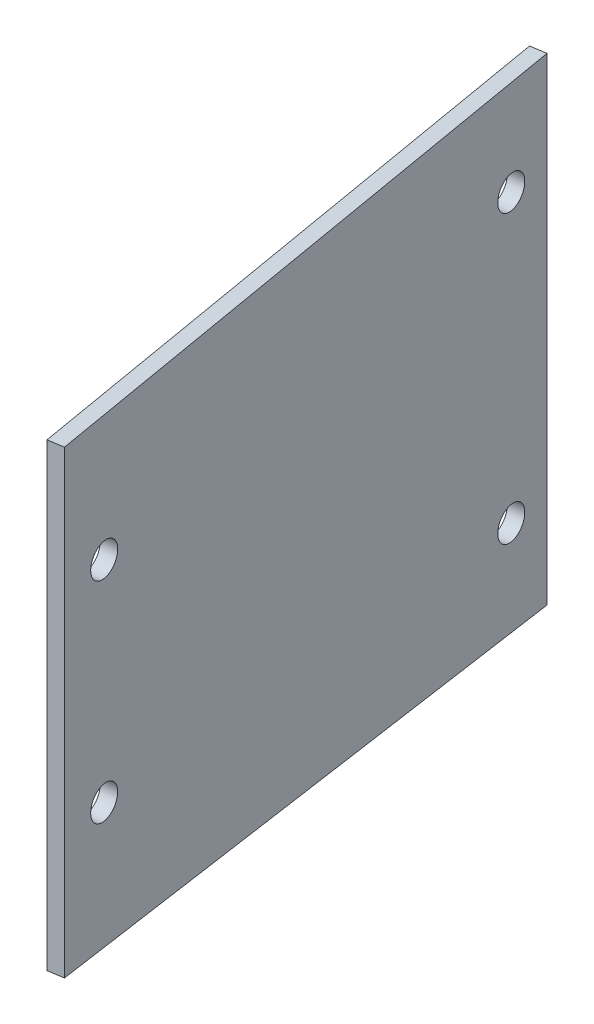
ISO-10303-21;
HEADER;
FILE_DESCRIPTION(('STEP AP214'),'2;1');
FILE_NAME('part.step','',(''),(''),'','','');
FILE_SCHEMA(('AUTOMOTIVE_DESIGN { 1 0 10303 214 1 1 1 1 }'));
ENDSEC;
DATA;
#1=APPLICATION_CONTEXT('core data for automotive mechanical design processes');
#2=APPLICATION_PROTOCOL_DEFINITION('international standard','automotive_design',2000,#1);
#3=PRODUCT_CONTEXT('',#1,'mechanical');
#4=PRODUCT('Part','Part','',(#3));
#5=PRODUCT_RELATED_PRODUCT_CATEGORY('part','',(#4));
#6=PRODUCT_DEFINITION_FORMATION('','',#4);
#7=PRODUCT_DEFINITION_CONTEXT('part definition',#1,'design');
#8=PRODUCT_DEFINITION('design','',#6,#7);
#9=PRODUCT_DEFINITION_SHAPE('','',#8);
#10=(LENGTH_UNIT() NAMED_UNIT(*) SI_UNIT(.MILLI.,.METRE.));
#11=(NAMED_UNIT(*) PLANE_ANGLE_UNIT() SI_UNIT($,.RADIAN.));
#12=(NAMED_UNIT(*) SI_UNIT($,.STERADIAN.) SOLID_ANGLE_UNIT());
#13=UNCERTAINTY_MEASURE_WITH_UNIT(LENGTH_MEASURE(1.E-05),#10,'distance_accuracy_value','');
#14=(GEOMETRIC_REPRESENTATION_CONTEXT(3) GLOBAL_UNCERTAINTY_ASSIGNED_CONTEXT((#13)) GLOBAL_UNIT_ASSIGNED_CONTEXT((#10,
#11,#12)) REPRESENTATION_CONTEXT('',''));
#15=CARTESIAN_POINT('',(0.,0.,0.));
#16=DIRECTION('',(0.,0.,1.));
#17=DIRECTION('',(1.,0.,0.));
#18=AXIS2_PLACEMENT_3D('',#15,#16,#17);
#19=CARTESIAN_POINT('',(-26.41968617812,-24.0560531885734,10.784783644869));
#20=DIRECTION('',(-0.156385221956874,0.,-0.987696138674997));
#21=DIRECTION('',(-0.987696138674997,0.,0.156385221956874));
#22=AXIS2_PLACEMENT_3D('',#19,#20,#21);
#23=PLANE('',#22);
#24=DIRECTION('',(0.,-1.,0.));
#25=VECTOR('',#24,1.);
#26=CARTESIAN_POINT('',(-28.,-24.0560531885734,11.035));
#27=LINE('',#26,#25);
#28=CARTESIAN_POINT('',(-28.,24.0560531885734,11.035));
#29=VERTEX_POINT('',#28);
#30=CARTESIAN_POINT('',(-28.,-24.0560531885734,11.035));
#31=VERTEX_POINT('',#30);
#32=EDGE_CURVE('E103',#29,#31,#27,.T.);
#33=ORIENTED_EDGE('',*,*,#32,.T.);
#34=DIRECTION('',(-0.987696138674997,0.,0.156385221956874));
#35=VECTOR('',#34,1.);
#36=CARTESIAN_POINT('',(-26.41968617812,-24.0560531885734,10.784783644869));
#37=LINE('',#36,#35);
#38=CARTESIAN_POINT('',(-26.41968617812,-24.0560531885734,10.784783644869));
#39=VERTEX_POINT('',#38);
#40=EDGE_CURVE('E11',#39,#31,#37,.T.);
#41=ORIENTED_EDGE('',*,*,#40,.F.);
#42=DIRECTION('',(0.,-1.,0.));
#43=VECTOR('',#42,1.);
#44=CARTESIAN_POINT('',(-26.41968617812,-24.0560531885734,10.784783644869));
#45=LINE('',#44,#43);
#46=CARTESIAN_POINT('',(-26.41968617812,24.0560531885734,10.784783644869));
#47=VERTEX_POINT('',#46);
#48=EDGE_CURVE('E91',#47,#39,#45,.T.);
#49=ORIENTED_EDGE('',*,*,#48,.F.);
#50=DIRECTION('',(-0.987696138674997,0.,0.156385221956874));
#51=VECTOR('',#50,1.);
#52=CARTESIAN_POINT('',(-26.41968617812,24.0560531885734,10.784783644869));
#53=LINE('',#52,#51);
#54=EDGE_CURVE('E99',#47,#29,#53,.T.);
#55=ORIENTED_EDGE('',*,*,#54,.T.);
#56=EDGE_LOOP('',(#33,#41,#49,#55));
#57=FACE_BOUND('',#56,.T.);
#58=ADVANCED_FACE('F40',(#57),#23,.F.);
#59=CARTESIAN_POINT('',(-35.91968617812,-25.,-49.215216355131));
#60=DIRECTION('',(-0.00242975740769189,0.999879293509196,-0.0153458362591067));
#61=DIRECTION('',(0.,0.0153458815580756,0.999882245026486));
#62=AXIS2_PLACEMENT_3D('',#59,#60,#61);
#63=PLANE('',#62);
#64=DIRECTION('',(-0.156366345245518,-0.0155370013693617,-0.987576917340117));
#65=VECTOR('',#64,1.);
#66=CARTESIAN_POINT('',(-37.5,-25.,-48.965));
#67=LINE('',#66,#65);
#68=CARTESIAN_POINT('',(-37.5,-25.,-48.965));
#69=VERTEX_POINT('',#68);
#70=EDGE_CURVE('E95',#31,#69,#67,.T.);
#71=ORIENTED_EDGE('',*,*,#70,.T.);
#72=DIRECTION('',(-0.987696138674997,0.,0.156385221956874));
#73=VECTOR('',#72,1.);
#74=CARTESIAN_POINT('',(-35.91968617812,-25.,-49.215216355131));
#75=LINE('',#74,#73);
#76=CARTESIAN_POINT('',(-35.91968617812,-25.,-49.215216355131));
#77=VERTEX_POINT('',#76);
#78=EDGE_CURVE('E48',#77,#69,#75,.T.);
#79=ORIENTED_EDGE('',*,*,#78,.F.);
#80=DIRECTION('',(-0.156366345245518,-0.0155370013693617,-0.987576917340117));
#81=VECTOR('',#80,1.);
#82=CARTESIAN_POINT('',(-35.91968617812,-25.,-49.215216355131));
#83=LINE('',#82,#81);
#84=EDGE_CURVE('E86',#39,#77,#83,.T.);
#85=ORIENTED_EDGE('',*,*,#84,.F.);
#86=ORIENTED_EDGE('',*,*,#40,.T.);
#87=EDGE_LOOP('',(#71,#79,#85,#86));
#88=FACE_BOUND('',#87,.T.);
#89=ADVANCED_FACE('F94',(#88),#63,.F.);
#90=CARTESIAN_POINT('',(-35.91968617812,25.,-49.215216355131));
#91=DIRECTION('',(0.156385221956874,0.,0.987696138674997));
#92=DIRECTION('',(0.987696138674997,0.,-0.156385221956874));
#93=AXIS2_PLACEMENT_3D('',#90,#91,#92);
#94=PLANE('',#93);
#95=DIRECTION('',(0.,1.,0.));
#96=VECTOR('',#95,1.);
#97=CARTESIAN_POINT('',(-37.5,25.,-48.965));
#98=LINE('',#97,#96);
#99=CARTESIAN_POINT('',(-37.5,25.,-48.965));
#100=VERTEX_POINT('',#99);
#101=EDGE_CURVE('E73',#69,#100,#98,.T.);
#102=ORIENTED_EDGE('',*,*,#101,.T.);
#103=DIRECTION('',(-0.987696138674997,0.,0.156385221956874));
#104=VECTOR('',#103,1.);
#105=CARTESIAN_POINT('',(-35.91968617812,25.,-49.215216355131));
#106=LINE('',#105,#104);
#107=CARTESIAN_POINT('',(-35.91968617812,25.,-49.215216355131));
#108=VERTEX_POINT('',#107);
#109=EDGE_CURVE('E96',#108,#100,#106,.T.);
#110=ORIENTED_EDGE('',*,*,#109,.F.);
#111=DIRECTION('',(0.,1.,0.));
#112=VECTOR('',#111,1.);
#113=CARTESIAN_POINT('',(-35.91968617812,25.,-49.215216355131));
#114=LINE('',#113,#112);
#115=EDGE_CURVE('E89',#77,#108,#114,.T.);
#116=ORIENTED_EDGE('',*,*,#115,.F.);
#117=ORIENTED_EDGE('',*,*,#78,.T.);
#118=EDGE_LOOP('',(#102,#110,#116,#117));
#119=FACE_BOUND('',#118,.T.);
#120=ADVANCED_FACE('F97',(#119),#94,.F.);
#121=CARTESIAN_POINT('',(-26.41968617812,24.0560531885734,10.784783644869));
#122=DIRECTION('',(-0.00242975740769189,-0.999879293509196,-0.0153458362591067));
#123=DIRECTION('',(0.,0.0153458815580756,-0.999882245026486));
#124=AXIS2_PLACEMENT_3D('',#121,#122,#123);
#125=PLANE('',#124);
#126=DIRECTION('',(0.156366345245518,-0.0155370013693617,0.987576917340117));
#127=VECTOR('',#126,1.);
#128=CARTESIAN_POINT('',(-28.,24.0560531885734,11.035));
#129=LINE('',#128,#127);
#130=EDGE_CURVE('E79',#100,#29,#129,.T.);
#131=ORIENTED_EDGE('',*,*,#130,.T.);
#132=ORIENTED_EDGE('',*,*,#54,.F.);
#133=DIRECTION('',(0.156366345245518,-0.0155370013693617,0.987576917340117));
#134=VECTOR('',#133,1.);
#135=CARTESIAN_POINT('',(-26.41968617812,24.0560531885734,10.784783644869));
#136=LINE('',#135,#134);
#137=EDGE_CURVE('E56',#108,#47,#136,.T.);
#138=ORIENTED_EDGE('',*,*,#137,.F.);
#139=ORIENTED_EDGE('',*,*,#109,.T.);
#140=EDGE_LOOP('',(#131,#132,#138,#139));
#141=FACE_BOUND('',#140,.T.);
#142=ADVANCED_FACE('F111',(#141),#125,.F.);
#143=CARTESIAN_POINT('',(-27.4393867404125,0.,4.34456956723198));
#144=DIRECTION('',(-0.987696138674997,0.,0.156385221956874));
#145=DIRECTION('',(0.156385221956874,0.,0.987696138674997));
#146=AXIS2_PLACEMENT_3D('',#143,#144,#145);
#147=PLANE('',#146);
#148=CARTESIAN_POINT('',(-35.2159526793141,15.,-44.7705837310935));
#149=DIRECTION('',(-0.987696138674997,0.,0.156385221956874));
#150=DIRECTION('',(0.156385221956874,0.,0.987696138674997));
#151=AXIS2_PLACEMENT_3D('',#148,#149,#150);
#152=CIRCLE('',#151,1.69999999999999);
#153=CARTESIAN_POINT('',(-34.9500978019874,15.,-43.091500295346));
#154=VERTEX_POINT('',#153);
#155=EDGE_CURVE('E126',#154,#154,#152,.T.);
#156=ORIENTED_EDGE('',*,*,#155,.T.);
#157=EDGE_LOOP('',(#156));
#158=FACE_BOUND('',#157,.T.);
#159=CARTESIAN_POINT('',(-35.2159526793141,-15.,-44.7705837310935));
#160=DIRECTION('',(-0.987696138674997,0.,0.156385221956874));
#161=DIRECTION('',(0.156385221956874,0.,0.987696138674997));
#162=AXIS2_PLACEMENT_3D('',#159,#160,#161);
#163=CIRCLE('',#162,1.7);
#164=CARTESIAN_POINT('',(-34.9500978019874,-15.,-43.091500295346));
#165=VERTEX_POINT('',#164);
#166=EDGE_CURVE('E131',#165,#165,#163,.T.);
#167=ORIENTED_EDGE('',*,*,#166,.T.);
#168=EDGE_LOOP('',(#167));
#169=FACE_BOUND('',#168,.T.);
#170=CARTESIAN_POINT('',(-27.2016122879044,-11.,5.84630295149402));
#171=DIRECTION('',(-0.987696138674997,0.,0.156385221956874));
#172=DIRECTION('',(0.156385221956874,0.,0.987696138674997));
#173=AXIS2_PLACEMENT_3D('',#170,#171,#172);
#174=CIRCLE('',#173,1.7);
#175=CARTESIAN_POINT('',(-26.9357574105777,-11.,7.52538638724152));
#176=VERTEX_POINT('',#175);
#177=EDGE_CURVE('E106',#176,#176,#174,.T.);
#178=ORIENTED_EDGE('',*,*,#177,.T.);
#179=EDGE_LOOP('',(#178));
#180=FACE_BOUND('',#179,.T.);
#181=CARTESIAN_POINT('',(-27.2016122879044,11.,5.84630295149401));
#182=DIRECTION('',(-0.987696138674997,0.,0.156385221956874));
#183=DIRECTION('',(0.156385221956874,0.,0.987696138674997));
#184=AXIS2_PLACEMENT_3D('',#181,#182,#183);
#185=CIRCLE('',#184,1.7);
#186=CARTESIAN_POINT('',(-26.9357574105777,11.,7.52538638724151));
#187=VERTEX_POINT('',#186);
#188=EDGE_CURVE('E119',#187,#187,#185,.T.);
#189=ORIENTED_EDGE('',*,*,#188,.T.);
#190=EDGE_LOOP('',(#189));
#191=FACE_BOUND('',#190,.T.);
#192=ORIENTED_EDGE('',*,*,#48,.T.);
#193=ORIENTED_EDGE('',*,*,#84,.T.);
#194=ORIENTED_EDGE('',*,*,#115,.T.);
#195=ORIENTED_EDGE('',*,*,#137,.T.);
#196=EDGE_LOOP('',(#192,#193,#194,#195));
#197=FACE_BOUND('',#196,.T.);
#198=ADVANCED_FACE('F87',(#158,#169,#180,#191,#197),#147,.F.);
#199=CARTESIAN_POINT('',(-29.0197005622925,0.,4.59478592236298));
#200=DIRECTION('',(-0.987696138674997,0.,0.156385221956874));
#201=DIRECTION('',(0.156385221956874,0.,0.987696138674997));
#202=AXIS2_PLACEMENT_3D('',#199,#200,#201);
#203=PLANE('',#202);
#204=CARTESIAN_POINT('',(-36.7962665011941,15.,-44.5203673759625));
#205=DIRECTION('',(-0.987696138674997,0.,0.156385221956874));
#206=DIRECTION('',(0.156385221956874,0.,0.987696138674997));
#207=AXIS2_PLACEMENT_3D('',#204,#205,#206);
#208=CIRCLE('',#207,1.69999999999999);
#209=CARTESIAN_POINT('',(-36.5304116238674,15.,-42.841283940215));
#210=VERTEX_POINT('',#209);
#211=EDGE_CURVE('E134',#210,#210,#208,.T.);
#212=ORIENTED_EDGE('',*,*,#211,.F.);
#213=EDGE_LOOP('',(#212));
#214=FACE_BOUND('',#213,.T.);
#215=CARTESIAN_POINT('',(-36.7962665011941,-15.,-44.5203673759625));
#216=DIRECTION('',(-0.987696138674997,0.,0.156385221956874));
#217=DIRECTION('',(0.156385221956874,0.,0.987696138674997));
#218=AXIS2_PLACEMENT_3D('',#215,#216,#217);
#219=CIRCLE('',#218,1.7);
#220=CARTESIAN_POINT('',(-36.5304116238674,-15.,-42.841283940215));
#221=VERTEX_POINT('',#220);
#222=EDGE_CURVE('E135',#221,#221,#219,.T.);
#223=ORIENTED_EDGE('',*,*,#222,.F.);
#224=EDGE_LOOP('',(#223));
#225=FACE_BOUND('',#224,.T.);
#226=CARTESIAN_POINT('',(-28.7819261097844,-11.,6.09651930662502));
#227=DIRECTION('',(-0.987696138674997,0.,0.156385221956874));
#228=DIRECTION('',(0.156385221956874,0.,0.987696138674997));
#229=AXIS2_PLACEMENT_3D('',#226,#227,#228);
#230=CIRCLE('',#229,1.7);
#231=CARTESIAN_POINT('',(-28.5160712324577,-11.,7.77560274237252));
#232=VERTEX_POINT('',#231);
#233=EDGE_CURVE('E122',#232,#232,#230,.T.);
#234=ORIENTED_EDGE('',*,*,#233,.F.);
#235=EDGE_LOOP('',(#234));
#236=FACE_BOUND('',#235,.T.);
#237=CARTESIAN_POINT('',(-28.7819261097844,11.,6.09651930662502));
#238=DIRECTION('',(-0.987696138674997,0.,0.156385221956874));
#239=DIRECTION('',(-0.156385221956874,0.,-0.987696138674997));
#240=AXIS2_PLACEMENT_3D('',#237,#238,#239);
#241=CIRCLE('',#240,1.7);
#242=CARTESIAN_POINT('',(-29.0477809871111,11.,4.41743587087752));
#243=VERTEX_POINT('',#242);
#244=EDGE_CURVE('E123',#243,#243,#241,.T.);
#245=ORIENTED_EDGE('',*,*,#244,.F.);
#246=EDGE_LOOP('',(#245));
#247=FACE_BOUND('',#246,.T.);
#248=ORIENTED_EDGE('',*,*,#32,.F.);
#249=ORIENTED_EDGE('',*,*,#130,.F.);
#250=ORIENTED_EDGE('',*,*,#101,.F.);
#251=ORIENTED_EDGE('',*,*,#70,.F.);
#252=EDGE_LOOP('',(#248,#249,#250,#251));
#253=FACE_BOUND('',#252,.T.);
#254=ADVANCED_FACE('F114',(#214,#225,#236,#247,#253),#203,.T.);
#255=CARTESIAN_POINT('',(-17.9339474955461,11.,4.37892269270396));
#256=DIRECTION('',(-0.987696138674997,0.,0.156385221956874));
#257=DIRECTION('',(0.156385221956874,0.,0.987696138674997));
#258=AXIS2_PLACEMENT_3D('',#255,#256,#257);
#259=CYLINDRICAL_SURFACE('',#258,1.7);
#260=ORIENTED_EDGE('',*,*,#244,.T.);
#261=EDGE_LOOP('',(#260));
#262=FACE_BOUND('',#261,.T.);
#263=ORIENTED_EDGE('',*,*,#188,.F.);
#264=EDGE_LOOP('',(#263));
#265=FACE_BOUND('',#264,.T.);
#266=ADVANCED_FACE('F146',(#262,#265),#259,.F.);
#267=CARTESIAN_POINT('',(-17.9339474955461,-11.,4.37892269270397));
#268=DIRECTION('',(-0.987696138674997,0.,0.156385221956874));
#269=DIRECTION('',(0.156385221956874,0.,0.987696138674997));
#270=AXIS2_PLACEMENT_3D('',#267,#268,#269);
#271=CYLINDRICAL_SURFACE('',#270,1.7);
#272=ORIENTED_EDGE('',*,*,#233,.T.);
#273=EDGE_LOOP('',(#272));
#274=FACE_BOUND('',#273,.T.);
#275=ORIENTED_EDGE('',*,*,#177,.F.);
#276=EDGE_LOOP('',(#275));
#277=FACE_BOUND('',#276,.T.);
#278=ADVANCED_FACE('F156',(#274,#277),#271,.F.);
#279=CARTESIAN_POINT('',(-25.9482878869558,-15.,-46.2379639898836));
#280=DIRECTION('',(-0.987696138674997,0.,0.156385221956874));
#281=DIRECTION('',(0.156385221956874,0.,0.987696138674997));
#282=AXIS2_PLACEMENT_3D('',#279,#280,#281);
#283=CYLINDRICAL_SURFACE('',#282,1.7);
#284=ORIENTED_EDGE('',*,*,#222,.T.);
#285=EDGE_LOOP('',(#284));
#286=FACE_BOUND('',#285,.T.);
#287=ORIENTED_EDGE('',*,*,#166,.F.);
#288=EDGE_LOOP('',(#287));
#289=FACE_BOUND('',#288,.T.);
#290=ADVANCED_FACE('F205',(#286,#289),#283,.F.);
#291=CARTESIAN_POINT('',(-25.9482878869558,15.,-46.2379639898836));
#292=DIRECTION('',(-0.987696138674997,0.,0.156385221956874));
#293=DIRECTION('',(0.156385221956874,0.,0.987696138674997));
#294=AXIS2_PLACEMENT_3D('',#291,#292,#293);
#295=CYLINDRICAL_SURFACE('',#294,1.69999999999999);
#296=ORIENTED_EDGE('',*,*,#211,.T.);
#297=EDGE_LOOP('',(#296));
#298=FACE_BOUND('',#297,.T.);
#299=ORIENTED_EDGE('',*,*,#155,.F.);
#300=EDGE_LOOP('',(#299));
#301=FACE_BOUND('',#300,.T.);
#302=ADVANCED_FACE('F141',(#298,#301),#295,.F.);
#303=CLOSED_SHELL('',(#58,#89,#120,#142,#198,#254,#266,#278,#290,#302));
#304=MANIFOLD_SOLID_BREP('B2',#303);
#305=ADVANCED_BREP_SHAPE_REPRESENTATION('',(#18,#304),#14);
#306=SHAPE_DEFINITION_REPRESENTATION(#9,#305);
ENDSEC;
END-ISO-10303-21;
